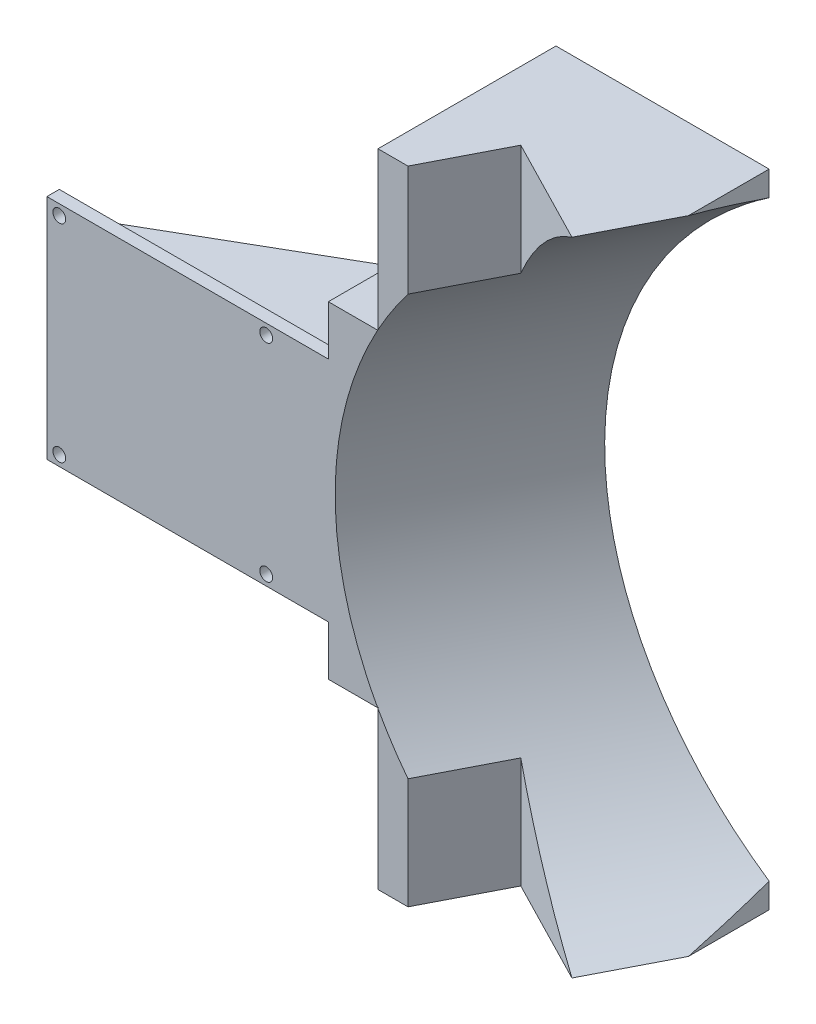
ISO-10303-21;
HEADER;
FILE_DESCRIPTION(('STEP AP214'),'2;1');
FILE_NAME('part.step','',(''),(''),'','','');
FILE_SCHEMA(('AUTOMOTIVE_DESIGN { 1 0 10303 214 1 1 1 1 }'));
ENDSEC;
DATA;
#1=APPLICATION_CONTEXT('core data for automotive mechanical design processes');
#2=APPLICATION_PROTOCOL_DEFINITION('international standard','automotive_design',2000,#1);
#3=PRODUCT_CONTEXT('',#1,'mechanical');
#4=PRODUCT('Part','Part','',(#3));
#5=PRODUCT_RELATED_PRODUCT_CATEGORY('part','',(#4));
#6=PRODUCT_DEFINITION_FORMATION('','',#4);
#7=PRODUCT_DEFINITION_CONTEXT('part definition',#1,'design');
#8=PRODUCT_DEFINITION('design','',#6,#7);
#9=PRODUCT_DEFINITION_SHAPE('','',#8);
#10=(LENGTH_UNIT() NAMED_UNIT(*) SI_UNIT(.MILLI.,.METRE.));
#11=(NAMED_UNIT(*) PLANE_ANGLE_UNIT() SI_UNIT($,.RADIAN.));
#12=(NAMED_UNIT(*) SI_UNIT($,.STERADIAN.) SOLID_ANGLE_UNIT());
#13=UNCERTAINTY_MEASURE_WITH_UNIT(LENGTH_MEASURE(1.E-05),#10,'distance_accuracy_value','');
#14=(GEOMETRIC_REPRESENTATION_CONTEXT(3) GLOBAL_UNCERTAINTY_ASSIGNED_CONTEXT((#13)) GLOBAL_UNIT_ASSIGNED_CONTEXT((#10,
#11,#12)) REPRESENTATION_CONTEXT('',''));
#15=CARTESIAN_POINT('',(0.,0.,0.));
#16=DIRECTION('',(0.,0.,1.));
#17=DIRECTION('',(1.,0.,0.));
#18=AXIS2_PLACEMENT_3D('',#15,#16,#17);
#19=CARTESIAN_POINT('',(0.,0.,0.));
#20=DIRECTION('',(0.,0.,1.));
#21=DIRECTION('',(1.,0.,0.));
#22=AXIS2_PLACEMENT_3D('',#19,#20,#21);
#23=PLANE('',#22);
#24=CARTESIAN_POINT('',(13.,25.,0.));
#25=DIRECTION('',(0.,0.,-1.));
#26=DIRECTION('',(-1.,0.,0.));
#27=AXIS2_PLACEMENT_3D('',#24,#25,#26);
#28=CIRCLE('',#27,1.55);
#29=CARTESIAN_POINT('',(11.45,25.,0.));
#30=VERTEX_POINT('',#29);
#31=EDGE_CURVE('E352',#30,#30,#28,.T.);
#32=ORIENTED_EDGE('',*,*,#31,.F.);
#33=EDGE_LOOP('',(#32));
#34=FACE_BOUND('',#33,.T.);
#35=CARTESIAN_POINT('',(-37.,25.,0.));
#36=DIRECTION('',(0.,0.,-1.));
#37=DIRECTION('',(-1.,0.,0.));
#38=AXIS2_PLACEMENT_3D('',#35,#36,#37);
#39=CIRCLE('',#38,1.55);
#40=CARTESIAN_POINT('',(-38.55,25.,0.));
#41=VERTEX_POINT('',#40);
#42=EDGE_CURVE('E357',#41,#41,#39,.T.);
#43=ORIENTED_EDGE('',*,*,#42,.F.);
#44=EDGE_LOOP('',(#43));
#45=FACE_BOUND('',#44,.T.);
#46=DIRECTION('',(1.,0.,0.));
#47=VECTOR('',#46,1.);
#48=CARTESIAN_POINT('',(-40.,18.5,0.));
#49=LINE('',#48,#47);
#50=CARTESIAN_POINT('',(-40.,18.5,0.));
#51=VERTEX_POINT('',#50);
#52=CARTESIAN_POINT('',(28.,18.5,0.));
#53=VERTEX_POINT('',#52);
#54=EDGE_CURVE('E226',#51,#53,#49,.T.);
#55=ORIENTED_EDGE('',*,*,#54,.F.);
#56=DIRECTION('',(0.,-1.,0.));
#57=VECTOR('',#56,1.);
#58=CARTESIAN_POINT('',(-40.,-27.5,0.));
#59=LINE('',#58,#57);
#60=CARTESIAN_POINT('',(-40.,27.5,0.));
#61=VERTEX_POINT('',#60);
#62=EDGE_CURVE('E387',#61,#51,#59,.T.);
#63=ORIENTED_EDGE('',*,*,#62,.F.);
#64=DIRECTION('',(-1.,0.,0.));
#65=VECTOR('',#64,1.);
#66=CARTESIAN_POINT('',(40.,27.5,0.));
#67=LINE('',#66,#65);
#68=CARTESIAN_POINT('',(28.,27.5,0.));
#69=VERTEX_POINT('',#68);
#70=EDGE_CURVE('E381',#69,#61,#67,.T.);
#71=ORIENTED_EDGE('',*,*,#70,.F.);
#72=DIRECTION('',(0.,1.,0.));
#73=VECTOR('',#72,1.);
#74=CARTESIAN_POINT('',(28.,27.5,0.));
#75=LINE('',#74,#73);
#76=EDGE_CURVE('E292',#53,#69,#75,.T.);
#77=ORIENTED_EDGE('',*,*,#76,.F.);
#78=EDGE_LOOP('',(#55,#63,#71,#77));
#79=FACE_BOUND('',#78,.T.);
#80=ADVANCED_FACE('F37',(#34,#45,#79),#23,.F.);
#81=CARTESIAN_POINT('',(-37.,-25.,0.));
#82=DIRECTION('',(0.,0.,-1.));
#83=DIRECTION('',(-1.,0.,0.));
#84=AXIS2_PLACEMENT_3D('',#81,#82,#83);
#85=CIRCLE('',#84,1.55);
#86=CARTESIAN_POINT('',(-38.55,-25.,0.));
#87=VERTEX_POINT('',#86);
#88=EDGE_CURVE('E353',#87,#87,#85,.T.);
#89=ORIENTED_EDGE('',*,*,#88,.F.);
#90=EDGE_LOOP('',(#89));
#91=FACE_BOUND('',#90,.T.);
#92=CARTESIAN_POINT('',(13.,-25.,0.));
#93=DIRECTION('',(0.,0.,-1.));
#94=DIRECTION('',(-1.,0.,0.));
#95=AXIS2_PLACEMENT_3D('',#92,#93,#94);
#96=CIRCLE('',#95,1.55);
#97=CARTESIAN_POINT('',(11.45,-25.,0.));
#98=VERTEX_POINT('',#97);
#99=EDGE_CURVE('E356',#98,#98,#96,.T.);
#100=ORIENTED_EDGE('',*,*,#99,.F.);
#101=EDGE_LOOP('',(#100));
#102=FACE_BOUND('',#101,.T.);
#103=DIRECTION('',(-1.,0.,0.));
#104=VECTOR('',#103,1.);
#105=CARTESIAN_POINT('',(-40.,-18.5,0.));
#106=LINE('',#105,#104);
#107=CARTESIAN_POINT('',(28.,-18.5,0.));
#108=VERTEX_POINT('',#107);
#109=CARTESIAN_POINT('',(-40.,-18.5,0.));
#110=VERTEX_POINT('',#109);
#111=EDGE_CURVE('E222',#108,#110,#106,.T.);
#112=ORIENTED_EDGE('',*,*,#111,.F.);
#113=CARTESIAN_POINT('',(28.,-27.5,0.));
#114=VERTEX_POINT('',#113);
#115=EDGE_CURVE('E293',#114,#108,#75,.T.);
#116=ORIENTED_EDGE('',*,*,#115,.F.);
#117=DIRECTION('',(1.,0.,0.));
#118=VECTOR('',#117,1.);
#119=CARTESIAN_POINT('',(40.,-27.5,0.));
#120=LINE('',#119,#118);
#121=CARTESIAN_POINT('',(-40.,-27.5,0.));
#122=VERTEX_POINT('',#121);
#123=EDGE_CURVE('E390',#122,#114,#120,.T.);
#124=ORIENTED_EDGE('',*,*,#123,.F.);
#125=EDGE_CURVE('E376',#110,#122,#59,.T.);
#126=ORIENTED_EDGE('',*,*,#125,.F.);
#127=EDGE_LOOP('',(#112,#116,#124,#126));
#128=FACE_BOUND('',#127,.T.);
#129=ADVANCED_FACE('F487',(#91,#102,#128),#23,.F.);
#130=CARTESIAN_POINT('',(28.,0.,0.));
#131=DIRECTION('',(-1.,0.,0.));
#132=DIRECTION('',(0.,0.,1.));
#133=AXIS2_PLACEMENT_3D('',#130,#131,#132);
#134=PLANE('',#133);
#135=DIRECTION('',(0.,-1.,0.));
#136=VECTOR('',#135,1.);
#137=CARTESIAN_POINT('',(28.,39.5,-40.));
#138=LINE('',#137,#136);
#139=CARTESIAN_POINT('',(28.,39.5,-40.));
#140=VERTEX_POINT('',#139);
#141=CARTESIAN_POINT('',(28.,18.5,-40.));
#142=VERTEX_POINT('',#141);
#143=EDGE_CURVE('E283',#140,#142,#138,.T.);
#144=ORIENTED_EDGE('',*,*,#143,.T.);
#145=DIRECTION('',(0.,0.,1.));
#146=VECTOR('',#145,1.);
#147=CARTESIAN_POINT('',(28.,18.5,-40.));
#148=LINE('',#147,#146);
#149=EDGE_CURVE('E221',#142,#53,#148,.T.);
#150=ORIENTED_EDGE('',*,*,#149,.T.);
#151=ORIENTED_EDGE('',*,*,#76,.T.);
#152=DIRECTION('',(0.,0.,1.));
#153=VECTOR('',#152,1.);
#154=CARTESIAN_POINT('',(28.,27.5,3.));
#155=LINE('',#154,#153);
#156=CARTESIAN_POINT('',(28.,27.5,3.));
#157=VERTEX_POINT('',#156);
#158=EDGE_CURVE('E296',#69,#157,#155,.T.);
#159=ORIENTED_EDGE('',*,*,#158,.T.);
#160=DIRECTION('',(0.,1.,0.));
#161=VECTOR('',#160,1.);
#162=CARTESIAN_POINT('',(28.,39.5,3.));
#163=LINE('',#162,#161);
#164=CARTESIAN_POINT('',(28.,39.5,3.));
#165=VERTEX_POINT('',#164);
#166=EDGE_CURVE('E298',#157,#165,#163,.T.);
#167=ORIENTED_EDGE('',*,*,#166,.T.);
#168=DIRECTION('',(0.,0.,-1.));
#169=VECTOR('',#168,1.);
#170=CARTESIAN_POINT('',(28.,39.5,-40.));
#171=LINE('',#170,#169);
#172=EDGE_CURVE('E300',#165,#140,#171,.T.);
#173=ORIENTED_EDGE('',*,*,#172,.T.);
#174=EDGE_LOOP('',(#144,#150,#151,#159,#167,#173));
#175=FACE_BOUND('',#174,.T.);
#176=ADVANCED_FACE('F493',(#175),#134,.T.);
#177=ORIENTED_EDGE('',*,*,#115,.T.);
#178=DIRECTION('',(0.,0.,1.));
#179=VECTOR('',#178,1.);
#180=CARTESIAN_POINT('',(28.,-18.5,-40.));
#181=LINE('',#180,#179);
#182=CARTESIAN_POINT('',(28.,-18.5,-40.));
#183=VERTEX_POINT('',#182);
#184=EDGE_CURVE('E232',#183,#108,#181,.T.);
#185=ORIENTED_EDGE('',*,*,#184,.F.);
#186=CARTESIAN_POINT('',(28.,-39.5,-40.));
#187=VERTEX_POINT('',#186);
#188=EDGE_CURVE('E286',#183,#187,#138,.T.);
#189=ORIENTED_EDGE('',*,*,#188,.T.);
#190=DIRECTION('',(0.,0.,1.));
#191=VECTOR('',#190,1.);
#192=CARTESIAN_POINT('',(28.,-39.5,-40.));
#193=LINE('',#192,#191);
#194=CARTESIAN_POINT('',(28.,-39.5,3.));
#195=VERTEX_POINT('',#194);
#196=EDGE_CURVE('E285',#187,#195,#193,.T.);
#197=ORIENTED_EDGE('',*,*,#196,.T.);
#198=DIRECTION('',(0.,1.,0.));
#199=VECTOR('',#198,1.);
#200=CARTESIAN_POINT('',(28.,-27.5,3.));
#201=LINE('',#200,#199);
#202=CARTESIAN_POINT('',(28.,-27.5,3.));
#203=VERTEX_POINT('',#202);
#204=EDGE_CURVE('E288',#195,#203,#201,.T.);
#205=ORIENTED_EDGE('',*,*,#204,.T.);
#206=DIRECTION('',(0.,0.,-1.));
#207=VECTOR('',#206,1.);
#208=CARTESIAN_POINT('',(28.,-27.5,0.));
#209=LINE('',#208,#207);
#210=EDGE_CURVE('E290',#203,#114,#209,.T.);
#211=ORIENTED_EDGE('',*,*,#210,.T.);
#212=EDGE_LOOP('',(#177,#185,#189,#197,#205,#211));
#213=FACE_BOUND('',#212,.T.);
#214=ADVANCED_FACE('F515',(#213),#134,.T.);
#215=CARTESIAN_POINT('',(0.,77.5,0.));
#216=DIRECTION('',(0.,1.,0.));
#217=DIRECTION('',(0.,0.,1.));
#218=AXIS2_PLACEMENT_3D('',#215,#216,#217);
#219=PLANE('',#218);
#220=DIRECTION('',(0.889287802318147,0.,0.457348012620761));
#221=VECTOR('',#220,1.);
#222=CARTESIAN_POINT('',(56.5,77.5,-15.));
#223=LINE('',#222,#221);
#224=CARTESIAN_POINT('',(56.5,77.5,-15.));
#225=VERTEX_POINT('',#224);
#226=CARTESIAN_POINT('',(81.9334748664187,77.5,-1.91992721155612));
#227=VERTEX_POINT('',#226);
#228=EDGE_CURVE('E268',#225,#227,#223,.T.);
#229=ORIENTED_EDGE('',*,*,#228,.T.);
#230=DIRECTION('',(0.457348012620761,0.,-0.889287802318147));
#231=VECTOR('',#230,1.);
#232=CARTESIAN_POINT('',(39.8574577053086,77.5,79.8945506017134));
#233=LINE('',#232,#231);
#234=CARTESIAN_POINT('',(91.5,77.5,-20.5215038601865));
#235=VERTEX_POINT('',#234);
#236=EDGE_CURVE('E265',#227,#235,#233,.T.);
#237=ORIENTED_EDGE('',*,*,#236,.T.);
#238=DIRECTION('',(0.,0.,-1.));
#239=VECTOR('',#238,1.);
#240=CARTESIAN_POINT('',(91.5,77.5,0.));
#241=LINE('',#240,#239);
#242=CARTESIAN_POINT('',(91.5,77.5,-40.));
#243=VERTEX_POINT('',#242);
#244=EDGE_CURVE('E347',#235,#243,#241,.T.);
#245=ORIENTED_EDGE('',*,*,#244,.T.);
#246=DIRECTION('',(1.,0.,0.));
#247=VECTOR('',#246,1.);
#248=CARTESIAN_POINT('',(91.5,77.5,-40.));
#249=LINE('',#248,#247);
#250=CARTESIAN_POINT('',(40.,77.5,-40.));
#251=VERTEX_POINT('',#250);
#252=EDGE_CURVE('E328',#251,#243,#249,.T.);
#253=ORIENTED_EDGE('',*,*,#252,.F.);
#254=DIRECTION('',(0.,0.,1.));
#255=VECTOR('',#254,1.);
#256=CARTESIAN_POINT('',(40.,77.5,0.));
#257=LINE('',#256,#255);
#258=CARTESIAN_POINT('',(40.,77.5,3.));
#259=VERTEX_POINT('',#258);
#260=EDGE_CURVE('E341',#251,#259,#257,.T.);
#261=ORIENTED_EDGE('',*,*,#260,.T.);
#262=DIRECTION('',(1.,0.,0.));
#263=VECTOR('',#262,1.);
#264=CARTESIAN_POINT('',(40.,77.5,3.));
#265=LINE('',#264,#263);
#266=CARTESIAN_POINT('',(47.2428571428572,77.5,3.));
#267=VERTEX_POINT('',#266);
#268=EDGE_CURVE('E344',#259,#267,#265,.T.);
#269=ORIENTED_EDGE('',*,*,#268,.T.);
#270=DIRECTION('',(-0.457348012620761,0.,0.889287802318147));
#271=VECTOR('',#270,1.);
#272=CARTESIAN_POINT('',(56.5,77.5,-15.));
#273=LINE('',#272,#271);
#274=EDGE_CURVE('E271',#225,#267,#273,.T.);
#275=ORIENTED_EDGE('',*,*,#274,.F.);
#276=EDGE_LOOP('',(#229,#237,#245,#253,#261,#269,#275));
#277=FACE_BOUND('',#276,.T.);
#278=ADVANCED_FACE('F421',(#277),#219,.T.);
#279=CARTESIAN_POINT('',(0.,-77.5,0.));
#280=DIRECTION('',(0.,-1.,0.));
#281=DIRECTION('',(1.,0.,0.));
#282=AXIS2_PLACEMENT_3D('',#279,#280,#281);
#283=PLANE('',#282);
#284=DIRECTION('',(0.,0.,1.));
#285=VECTOR('',#284,1.);
#286=CARTESIAN_POINT('',(91.5,-77.5,3.));
#287=LINE('',#286,#285);
#288=CARTESIAN_POINT('',(91.5,-77.5,-40.));
#289=VERTEX_POINT('',#288);
#290=CARTESIAN_POINT('',(91.5,-77.5,-20.5215038601866));
#291=VERTEX_POINT('',#290);
#292=EDGE_CURVE('E333',#289,#291,#287,.T.);
#293=ORIENTED_EDGE('',*,*,#292,.T.);
#294=DIRECTION('',(0.457348012620761,0.,-0.889287802318147));
#295=VECTOR('',#294,1.);
#296=CARTESIAN_POINT('',(39.8574577053086,-77.5,79.8945506017134));
#297=LINE('',#296,#295);
#298=CARTESIAN_POINT('',(81.9334748664186,-77.5,-1.91992721155614));
#299=VERTEX_POINT('',#298);
#300=EDGE_CURVE('E249',#291,#299,#297,.F.);
#301=ORIENTED_EDGE('',*,*,#300,.T.);
#302=DIRECTION('',(-0.889287802318147,0.,-0.457348012620761));
#303=VECTOR('',#302,1.);
#304=CARTESIAN_POINT('',(17.9186571981924,-77.5,-34.8418334409296));
#305=LINE('',#304,#303);
#306=CARTESIAN_POINT('',(56.5,-77.5,-15.));
#307=VERTEX_POINT('',#306);
#308=EDGE_CURVE('E402',#299,#307,#305,.T.);
#309=ORIENTED_EDGE('',*,*,#308,.T.);
#310=DIRECTION('',(0.457348012620761,0.,-0.889287802318147));
#311=VECTOR('',#310,1.);
#312=CARTESIAN_POINT('',(38.5813428018076,-77.5,19.8418334409296));
#313=LINE('',#312,#311);
#314=CARTESIAN_POINT('',(47.2428571428572,-77.5,3.));
#315=VERTEX_POINT('',#314);
#316=EDGE_CURVE('E399',#315,#307,#313,.T.);
#317=ORIENTED_EDGE('',*,*,#316,.F.);
#318=DIRECTION('',(-1.,0.,0.));
#319=VECTOR('',#318,1.);
#320=CARTESIAN_POINT('',(40.,-77.5,3.));
#321=LINE('',#320,#319);
#322=CARTESIAN_POINT('',(40.,-77.5,3.));
#323=VERTEX_POINT('',#322);
#324=EDGE_CURVE('E336',#315,#323,#321,.T.);
#325=ORIENTED_EDGE('',*,*,#324,.T.);
#326=DIRECTION('',(0.,0.,-1.));
#327=VECTOR('',#326,1.);
#328=CARTESIAN_POINT('',(40.,-77.5,3.));
#329=LINE('',#328,#327);
#330=CARTESIAN_POINT('',(40.,-77.5,-40.));
#331=VERTEX_POINT('',#330);
#332=EDGE_CURVE('E331',#323,#331,#329,.T.);
#333=ORIENTED_EDGE('',*,*,#332,.T.);
#334=DIRECTION('',(-1.,0.,0.));
#335=VECTOR('',#334,1.);
#336=CARTESIAN_POINT('',(91.5,-77.5,-40.));
#337=LINE('',#336,#335);
#338=EDGE_CURVE('E321',#289,#331,#337,.T.);
#339=ORIENTED_EDGE('',*,*,#338,.F.);
#340=EDGE_LOOP('',(#293,#301,#309,#317,#325,#333,#339));
#341=FACE_BOUND('',#340,.T.);
#342=ADVANCED_FACE('F456',(#341),#283,.T.);
#343=CARTESIAN_POINT('',(0.,0.,3.));
#344=DIRECTION('',(0.,0.,1.));
#345=DIRECTION('',(1.,0.,0.));
#346=AXIS2_PLACEMENT_3D('',#343,#344,#345);
#347=PLANE('',#346);
#348=DIRECTION('',(0.,1.,0.));
#349=VECTOR('',#348,1.);
#350=CARTESIAN_POINT('',(47.2428571428572,-106.5,3.));
#351=LINE('',#350,#349);
#352=CARTESIAN_POINT('',(47.2428571428572,-50.7048951129809,3.));
#353=VERTEX_POINT('',#352);
#354=EDGE_CURVE('E279',#315,#353,#351,.T.);
#355=ORIENTED_EDGE('',*,*,#354,.T.);
#356=CARTESIAN_POINT('',(130.857337308309,0.,3.));
#357=DIRECTION('',(0.,0.,1.));
#358=DIRECTION('',(1.,0.,0.));
#359=AXIS2_PLACEMENT_3D('',#356,#357,#358);
#360=ELLIPSE('',#359,101.204581649937,90.);
#361=CARTESIAN_POINT('',(40.,-39.643803944263,3.));
#362=VERTEX_POINT('',#361);
#363=EDGE_CURVE('E241',#353,#362,#360,.F.);
#364=ORIENTED_EDGE('',*,*,#363,.T.);
#365=DIRECTION('',(0.,1.,0.));
#366=VECTOR('',#365,1.);
#367=CARTESIAN_POINT('',(40.,-77.5,3.));
#368=LINE('',#367,#366);
#369=EDGE_CURVE('E338',#323,#362,#368,.T.);
#370=ORIENTED_EDGE('',*,*,#369,.F.);
#371=ORIENTED_EDGE('',*,*,#324,.F.);
#372=EDGE_LOOP('',(#355,#364,#370,#371));
#373=FACE_BOUND('',#372,.T.);
#374=ADVANCED_FACE('F461',(#373),#347,.T.);
#375=CARTESIAN_POINT('',(13.,-25.,3.));
#376=DIRECTION('',(0.,0.,1.));
#377=DIRECTION('',(1.,0.,0.));
#378=AXIS2_PLACEMENT_3D('',#375,#376,#377);
#379=CIRCLE('',#378,1.55);
#380=CARTESIAN_POINT('',(14.55,-25.,3.));
#381=VERTEX_POINT('',#380);
#382=EDGE_CURVE('E364',#381,#381,#379,.T.);
#383=ORIENTED_EDGE('',*,*,#382,.F.);
#384=EDGE_LOOP('',(#383));
#385=FACE_BOUND('',#384,.T.);
#386=CARTESIAN_POINT('',(-37.,-25.,3.));
#387=DIRECTION('',(0.,0.,1.));
#388=DIRECTION('',(1.,0.,0.));
#389=AXIS2_PLACEMENT_3D('',#386,#387,#388);
#390=CIRCLE('',#389,1.55);
#391=CARTESIAN_POINT('',(-35.45,-25.,3.));
#392=VERTEX_POINT('',#391);
#393=EDGE_CURVE('E367',#392,#392,#390,.T.);
#394=ORIENTED_EDGE('',*,*,#393,.F.);
#395=EDGE_LOOP('',(#394));
#396=FACE_BOUND('',#395,.T.);
#397=CARTESIAN_POINT('',(-37.,25.,3.));
#398=DIRECTION('',(0.,0.,1.));
#399=DIRECTION('',(1.,0.,0.));
#400=AXIS2_PLACEMENT_3D('',#397,#398,#399);
#401=CIRCLE('',#400,1.55);
#402=CARTESIAN_POINT('',(-35.45,25.,3.));
#403=VERTEX_POINT('',#402);
#404=EDGE_CURVE('E370',#403,#403,#401,.T.);
#405=ORIENTED_EDGE('',*,*,#404,.F.);
#406=EDGE_LOOP('',(#405));
#407=FACE_BOUND('',#406,.T.);
#408=CARTESIAN_POINT('',(13.,25.,3.));
#409=DIRECTION('',(0.,0.,1.));
#410=DIRECTION('',(1.,0.,0.));
#411=AXIS2_PLACEMENT_3D('',#408,#409,#410);
#412=CIRCLE('',#411,1.55);
#413=CARTESIAN_POINT('',(14.55,25.,3.));
#414=VERTEX_POINT('',#413);
#415=EDGE_CURVE('E373',#414,#414,#412,.T.);
#416=ORIENTED_EDGE('',*,*,#415,.F.);
#417=EDGE_LOOP('',(#416));
#418=FACE_BOUND('',#417,.T.);
#419=DIRECTION('',(1.,0.,0.));
#420=VECTOR('',#419,1.);
#421=CARTESIAN_POINT('',(28.,-39.5,3.));
#422=LINE('',#421,#420);
#423=CARTESIAN_POINT('',(39.9208367001529,-39.5,3.));
#424=VERTEX_POINT('',#423);
#425=EDGE_CURVE('E312',#195,#424,#422,.T.);
#426=ORIENTED_EDGE('',*,*,#425,.T.);
#427=CARTESIAN_POINT('',(39.9208367001529,39.5,3.));
#428=VERTEX_POINT('',#427);
#429=EDGE_CURVE('E247',#424,#428,#360,.F.);
#430=ORIENTED_EDGE('',*,*,#429,.T.);
#431=DIRECTION('',(1.,0.,0.));
#432=VECTOR('',#431,1.);
#433=CARTESIAN_POINT('',(28.,39.5,3.));
#434=LINE('',#433,#432);
#435=EDGE_CURVE('E309',#165,#428,#434,.T.);
#436=ORIENTED_EDGE('',*,*,#435,.F.);
#437=ORIENTED_EDGE('',*,*,#166,.F.);
#438=DIRECTION('',(-1.,0.,0.));
#439=VECTOR('',#438,1.);
#440=CARTESIAN_POINT('',(40.,27.5,3.));
#441=LINE('',#440,#439);
#442=CARTESIAN_POINT('',(-40.,27.5,3.));
#443=VERTEX_POINT('',#442);
#444=EDGE_CURVE('E384',#157,#443,#441,.T.);
#445=ORIENTED_EDGE('',*,*,#444,.T.);
#446=DIRECTION('',(0.,-1.,0.));
#447=VECTOR('',#446,1.);
#448=CARTESIAN_POINT('',(-40.,-27.5,3.));
#449=LINE('',#448,#447);
#450=CARTESIAN_POINT('',(-40.,-27.5,3.));
#451=VERTEX_POINT('',#450);
#452=EDGE_CURVE('E377',#443,#451,#449,.T.);
#453=ORIENTED_EDGE('',*,*,#452,.T.);
#454=DIRECTION('',(1.,0.,0.));
#455=VECTOR('',#454,1.);
#456=CARTESIAN_POINT('',(40.,-27.5,3.));
#457=LINE('',#456,#455);
#458=EDGE_CURVE('E380',#451,#203,#457,.T.);
#459=ORIENTED_EDGE('',*,*,#458,.T.);
#460=ORIENTED_EDGE('',*,*,#204,.F.);
#461=EDGE_LOOP('',(#426,#430,#436,#437,#445,#453,#459,#460));
#462=FACE_BOUND('',#461,.T.);
#463=ADVANCED_FACE('F437',(#385,#396,#407,#418,#462),#347,.T.);
#464=CARTESIAN_POINT('',(91.5,0.,0.));
#465=DIRECTION('',(1.,0.,0.));
#466=DIRECTION('',(0.,0.,-1.));
#467=AXIS2_PLACEMENT_3D('',#464,#465,#466);
#468=PLANE('',#467);
#469=DIRECTION('',(0.,-1.,0.));
#470=VECTOR('',#469,1.);
#471=CARTESIAN_POINT('',(91.5,77.5,-40.));
#472=LINE('',#471,#470);
#473=CARTESIAN_POINT('',(91.5,-71.4956804332756,-40.));
#474=VERTEX_POINT('',#473);
#475=EDGE_CURVE('E317',#474,#289,#472,.T.);
#476=ORIENTED_EDGE('',*,*,#475,.F.);
#477=CARTESIAN_POINT('',(91.5,0.,79.5281558772672));
#478=DIRECTION('',(1.,0.,0.));
#479=DIRECTION('',(0.,0.,-1.));
#480=AXIS2_PLACEMENT_3D('',#477,#478,#479);
#481=ELLIPSE('',#480,196.786686541544,90.);
#482=EDGE_CURVE('E254',#474,#291,#481,.F.);
#483=ORIENTED_EDGE('',*,*,#482,.T.);
#484=ORIENTED_EDGE('',*,*,#292,.F.);
#485=EDGE_LOOP('',(#476,#483,#484));
#486=FACE_BOUND('',#485,.T.);
#487=ADVANCED_FACE('F470',(#486),#468,.T.);
#488=CARTESIAN_POINT('',(28.,-39.5,-40.));
#489=DIRECTION('',(0.,1.,0.));
#490=DIRECTION('',(0.,0.,1.));
#491=AXIS2_PLACEMENT_3D('',#488,#489,#490);
#492=PLANE('',#491);
#493=DIRECTION('',(0.457348012620761,0.,-0.889287802318147));
#494=VECTOR('',#493,1.);
#495=CARTESIAN_POINT('',(8.63348894456285,-39.5,63.8365095247585));
#496=LINE('',#495,#494);
#497=CARTESIAN_POINT('',(40.,-39.5,2.84607136140836));
#498=VERTEX_POINT('',#497);
#499=EDGE_CURVE('E252',#424,#498,#496,.T.);
#500=ORIENTED_EDGE('',*,*,#499,.F.);
#501=ORIENTED_EDGE('',*,*,#425,.F.);
#502=ORIENTED_EDGE('',*,*,#196,.F.);
#503=DIRECTION('',(1.,0.,0.));
#504=VECTOR('',#503,1.);
#505=CARTESIAN_POINT('',(28.,-39.5,-40.));
#506=LINE('',#505,#504);
#507=CARTESIAN_POINT('',(40.,-39.5,-40.));
#508=VERTEX_POINT('',#507);
#509=EDGE_CURVE('E315',#187,#508,#506,.T.);
#510=ORIENTED_EDGE('',*,*,#509,.T.);
#511=DIRECTION('',(0.,0.,1.));
#512=VECTOR('',#511,1.);
#513=CARTESIAN_POINT('',(40.,-39.5,-40.));
#514=LINE('',#513,#512);
#515=EDGE_CURVE('E282',#508,#498,#514,.T.);
#516=ORIENTED_EDGE('',*,*,#515,.T.);
#517=EDGE_LOOP('',(#500,#501,#502,#510,#516));
#518=FACE_BOUND('',#517,.T.);
#519=ADVANCED_FACE('F444',(#518),#492,.F.);
#520=CARTESIAN_POINT('',(28.,39.5,-40.));
#521=DIRECTION('',(0.,-1.,0.));
#522=DIRECTION('',(0.,0.,-1.));
#523=AXIS2_PLACEMENT_3D('',#520,#521,#522);
#524=PLANE('',#523);
#525=DIRECTION('',(0.457348012620761,0.,-0.889287802318147));
#526=VECTOR('',#525,1.);
#527=CARTESIAN_POINT('',(8.63348894456285,39.5,63.8365095247585));
#528=LINE('',#527,#526);
#529=CARTESIAN_POINT('',(40.,39.5,2.84607136140843));
#530=VERTEX_POINT('',#529);
#531=EDGE_CURVE('E258',#530,#428,#528,.F.);
#532=ORIENTED_EDGE('',*,*,#531,.F.);
#533=DIRECTION('',(0.,0.,-1.));
#534=VECTOR('',#533,1.);
#535=CARTESIAN_POINT('',(40.,39.5,-40.));
#536=LINE('',#535,#534);
#537=CARTESIAN_POINT('',(40.,39.5,-40.));
#538=VERTEX_POINT('',#537);
#539=EDGE_CURVE('E305',#530,#538,#536,.T.);
#540=ORIENTED_EDGE('',*,*,#539,.T.);
#541=DIRECTION('',(1.,0.,0.));
#542=VECTOR('',#541,1.);
#543=CARTESIAN_POINT('',(28.,39.5,-40.));
#544=LINE('',#543,#542);
#545=EDGE_CURVE('E302',#140,#538,#544,.T.);
#546=ORIENTED_EDGE('',*,*,#545,.F.);
#547=ORIENTED_EDGE('',*,*,#172,.F.);
#548=ORIENTED_EDGE('',*,*,#435,.T.);
#549=EDGE_LOOP('',(#532,#540,#546,#547,#548));
#550=FACE_BOUND('',#549,.T.);
#551=ADVANCED_FACE('F431',(#550),#524,.F.);
#552=CARTESIAN_POINT('',(56.5,-106.5,-15.));
#553=DIRECTION('',(-0.457348012620761,0.,0.889287802318147));
#554=DIRECTION('',(0.889287802318147,0.,0.457348012620761));
#555=AXIS2_PLACEMENT_3D('',#552,#553,#554);
#556=PLANE('',#555);
#557=ORIENTED_EDGE('',*,*,#308,.F.);
#558=CARTESIAN_POINT('',(122.625073081135,0.,19.0071804417266));
#559=DIRECTION('',(-0.457348012620761,0.,0.889287802318147));
#560=DIRECTION('',(0.889287802318147,0.,0.457348012620761));
#561=AXIS2_PLACEMENT_3D('',#558,#559,#560);
#562=CIRCLE('',#561,90.);
#563=CARTESIAN_POINT('',(56.5,-50.7048951129809,-15.));
#564=VERTEX_POINT('',#563);
#565=EDGE_CURVE('E238',#299,#564,#562,.F.);
#566=ORIENTED_EDGE('',*,*,#565,.T.);
#567=DIRECTION('',(0.,1.,0.));
#568=VECTOR('',#567,1.);
#569=CARTESIAN_POINT('',(56.5,-106.5,-15.));
#570=LINE('',#569,#568);
#571=EDGE_CURVE('E275',#307,#564,#570,.T.);
#572=ORIENTED_EDGE('',*,*,#571,.F.);
#573=EDGE_LOOP('',(#557,#566,#572));
#574=FACE_BOUND('',#573,.T.);
#575=ADVANCED_FACE('F468',(#574),#556,.T.);
#576=CARTESIAN_POINT('',(56.5,-106.5,-15.));
#577=DIRECTION('',(-0.889287802318147,0.,-0.457348012620761));
#578=DIRECTION('',(-0.457348012620761,0.,0.889287802318147));
#579=AXIS2_PLACEMENT_3D('',#576,#577,#578);
#580=PLANE('',#579);
#581=DIRECTION('',(0.457348012620761,0.,-0.889287802318147));
#582=VECTOR('',#581,1.);
#583=CARTESIAN_POINT('',(14.42398283889,50.7048951129809,66.8144778132696));
#584=LINE('',#583,#582);
#585=CARTESIAN_POINT('',(56.5,50.7048951129808,-15.));
#586=VERTEX_POINT('',#585);
#587=CARTESIAN_POINT('',(47.2428571428572,50.7048951129809,3.));
#588=VERTEX_POINT('',#587);
#589=EDGE_CURVE('E45',#586,#588,#584,.F.);
#590=ORIENTED_EDGE('',*,*,#589,.F.);
#591=EDGE_CURVE('E274',#586,#225,#570,.T.);
#592=ORIENTED_EDGE('',*,*,#591,.T.);
#593=ORIENTED_EDGE('',*,*,#274,.T.);
#594=EDGE_CURVE('E278',#588,#267,#351,.T.);
#595=ORIENTED_EDGE('',*,*,#594,.F.);
#596=EDGE_LOOP('',(#590,#592,#593,#595));
#597=FACE_BOUND('',#596,.T.);
#598=ADVANCED_FACE('F417',(#597),#580,.F.);
#599=DIRECTION('',(0.457348012620761,0.,-0.889287802318147));
#600=VECTOR('',#599,1.);
#601=CARTESIAN_POINT('',(14.42398283889,-50.7048951129809,66.8144778132696));
#602=LINE('',#601,#600);
#603=EDGE_CURVE('E404',#353,#564,#602,.T.);
#604=ORIENTED_EDGE('',*,*,#603,.F.);
#605=ORIENTED_EDGE('',*,*,#354,.F.);
#606=ORIENTED_EDGE('',*,*,#316,.T.);
#607=ORIENTED_EDGE('',*,*,#571,.T.);
#608=EDGE_LOOP('',(#604,#605,#606,#607));
#609=FACE_BOUND('',#608,.T.);
#610=ADVANCED_FACE('F464',(#609),#580,.F.);
#611=CARTESIAN_POINT('',(40.,77.5,0.));
#612=DIRECTION('',(1.,0.,0.));
#613=DIRECTION('',(0.,0.,-1.));
#614=AXIS2_PLACEMENT_3D('',#611,#612,#613);
#615=PLANE('',#614);
#616=CARTESIAN_POINT('',(40.,0.,179.667044766156));
#617=DIRECTION('',(1.,0.,0.));
#618=DIRECTION('',(0.,0.,-1.));
#619=AXIS2_PLACEMENT_3D('',#616,#617,#618);
#620=ELLIPSE('',#619,196.786686541544,90.);
#621=EDGE_CURVE('E245',#498,#362,#620,.F.);
#622=ORIENTED_EDGE('',*,*,#621,.F.);
#623=ORIENTED_EDGE('',*,*,#515,.F.);
#624=DIRECTION('',(0.,1.,0.));
#625=VECTOR('',#624,1.);
#626=CARTESIAN_POINT('',(40.,77.5,-40.));
#627=LINE('',#626,#625);
#628=EDGE_CURVE('E325',#331,#508,#627,.T.);
#629=ORIENTED_EDGE('',*,*,#628,.F.);
#630=ORIENTED_EDGE('',*,*,#332,.F.);
#631=ORIENTED_EDGE('',*,*,#369,.T.);
#632=EDGE_LOOP('',(#622,#623,#629,#630,#631));
#633=FACE_BOUND('',#632,.T.);
#634=ADVANCED_FACE('F450',(#633),#615,.F.);
#635=CARTESIAN_POINT('',(40.,0.,179.667044766156));
#636=DIRECTION('',(1.,0.,0.));
#637=DIRECTION('',(0.,0.,-1.));
#638=AXIS2_PLACEMENT_3D('',#635,#636,#637);
#639=ELLIPSE('',#638,196.786686541544,90.);
#640=CARTESIAN_POINT('',(40.,39.6438039442631,3.));
#641=VERTEX_POINT('',#640);
#642=EDGE_CURVE('E263',#641,#530,#639,.F.);
#643=ORIENTED_EDGE('',*,*,#642,.F.);
#644=DIRECTION('',(0.,-1.,0.));
#645=VECTOR('',#644,1.);
#646=CARTESIAN_POINT('',(40.,77.5,3.));
#647=LINE('',#646,#645);
#648=EDGE_CURVE('E349',#259,#641,#647,.T.);
#649=ORIENTED_EDGE('',*,*,#648,.F.);
#650=ORIENTED_EDGE('',*,*,#260,.F.);
#651=EDGE_CURVE('E324',#538,#251,#627,.T.);
#652=ORIENTED_EDGE('',*,*,#651,.F.);
#653=ORIENTED_EDGE('',*,*,#539,.F.);
#654=EDGE_LOOP('',(#643,#649,#650,#652,#653));
#655=FACE_BOUND('',#654,.T.);
#656=ADVANCED_FACE('F426',(#655),#615,.F.);
#657=CARTESIAN_POINT('',(40.,-27.5,3.));
#658=DIRECTION('',(0.,1.,0.));
#659=DIRECTION('',(-1.,0.,0.));
#660=AXIS2_PLACEMENT_3D('',#657,#658,#659);
#661=PLANE('',#660);
#662=ORIENTED_EDGE('',*,*,#123,.T.);
#663=ORIENTED_EDGE('',*,*,#210,.F.);
#664=ORIENTED_EDGE('',*,*,#458,.F.);
#665=DIRECTION('',(0.,0.,-1.));
#666=VECTOR('',#665,1.);
#667=CARTESIAN_POINT('',(-40.,-27.5,3.));
#668=LINE('',#667,#666);
#669=EDGE_CURVE('E396',#451,#122,#668,.T.);
#670=ORIENTED_EDGE('',*,*,#669,.T.);
#671=EDGE_LOOP('',(#662,#663,#664,#670));
#672=FACE_BOUND('',#671,.T.);
#673=ADVANCED_FACE('F501',(#672),#661,.F.);
#674=CARTESIAN_POINT('',(40.,27.5,3.));
#675=DIRECTION('',(0.,-1.,0.));
#676=DIRECTION('',(1.,0.,0.));
#677=AXIS2_PLACEMENT_3D('',#674,#675,#676);
#678=PLANE('',#677);
#679=ORIENTED_EDGE('',*,*,#444,.F.);
#680=ORIENTED_EDGE('',*,*,#158,.F.);
#681=ORIENTED_EDGE('',*,*,#70,.T.);
#682=DIRECTION('',(0.,0.,-1.));
#683=VECTOR('',#682,1.);
#684=CARTESIAN_POINT('',(-40.,27.5,3.));
#685=LINE('',#684,#683);
#686=EDGE_CURVE('E386',#443,#61,#685,.T.);
#687=ORIENTED_EDGE('',*,*,#686,.F.);
#688=EDGE_LOOP('',(#679,#680,#681,#687));
#689=FACE_BOUND('',#688,.T.);
#690=ADVANCED_FACE('F499',(#689),#678,.F.);
#691=CARTESIAN_POINT('',(-40.,-27.5,3.));
#692=DIRECTION('',(1.,0.,0.));
#693=DIRECTION('',(0.,0.,-1.));
#694=AXIS2_PLACEMENT_3D('',#691,#692,#693);
#695=PLANE('',#694);
#696=DIRECTION('',(0.,0.,1.));
#697=VECTOR('',#696,1.);
#698=CARTESIAN_POINT('',(-40.,18.5,-40.));
#699=LINE('',#698,#697);
#700=CARTESIAN_POINT('',(-40.,18.5,-5.84857022564558));
#701=VERTEX_POINT('',#700);
#702=EDGE_CURVE('E236',#701,#51,#699,.T.);
#703=ORIENTED_EDGE('',*,*,#702,.F.);
#704=DIRECTION('',(0.,1.,0.));
#705=VECTOR('',#704,1.);
#706=CARTESIAN_POINT('',(-40.,-37.5,-5.84857022564558));
#707=LINE('',#706,#705);
#708=CARTESIAN_POINT('',(-40.,-18.5,-5.84857022564558));
#709=VERTEX_POINT('',#708);
#710=EDGE_CURVE('E204',#709,#701,#707,.T.);
#711=ORIENTED_EDGE('',*,*,#710,.F.);
#712=DIRECTION('',(0.,0.,1.));
#713=VECTOR('',#712,1.);
#714=CARTESIAN_POINT('',(-40.,-18.5,-40.));
#715=LINE('',#714,#713);
#716=EDGE_CURVE('E59',#709,#110,#715,.T.);
#717=ORIENTED_EDGE('',*,*,#716,.T.);
#718=ORIENTED_EDGE('',*,*,#125,.T.);
#719=ORIENTED_EDGE('',*,*,#669,.F.);
#720=ORIENTED_EDGE('',*,*,#452,.F.);
#721=ORIENTED_EDGE('',*,*,#686,.T.);
#722=ORIENTED_EDGE('',*,*,#62,.T.);
#723=EDGE_LOOP('',(#703,#711,#717,#718,#719,#720,#721,#722));
#724=FACE_BOUND('',#723,.T.);
#725=ADVANCED_FACE('F39',(#724),#695,.F.);
#726=ORIENTED_EDGE('',*,*,#648,.T.);
#727=EDGE_CURVE('E246',#641,#588,#360,.F.);
#728=ORIENTED_EDGE('',*,*,#727,.T.);
#729=ORIENTED_EDGE('',*,*,#594,.T.);
#730=ORIENTED_EDGE('',*,*,#268,.F.);
#731=EDGE_LOOP('',(#726,#728,#729,#730));
#732=FACE_BOUND('',#731,.T.);
#733=ADVANCED_FACE('F415',(#732),#347,.T.);
#734=CARTESIAN_POINT('',(13.,-25.,24.5));
#735=DIRECTION('',(0.,0.,-1.));
#736=DIRECTION('',(-1.,0.,0.));
#737=AXIS2_PLACEMENT_3D('',#734,#735,#736);
#738=CYLINDRICAL_SURFACE('',#737,1.55);
#739=ORIENTED_EDGE('',*,*,#382,.T.);
#740=EDGE_LOOP('',(#739));
#741=FACE_BOUND('',#740,.T.);
#742=ORIENTED_EDGE('',*,*,#99,.T.);
#743=EDGE_LOOP('',(#742));
#744=FACE_BOUND('',#743,.T.);
#745=ADVANCED_FACE('F657',(#741,#744),#738,.F.);
#746=CARTESIAN_POINT('',(-37.,-25.,24.5));
#747=DIRECTION('',(0.,0.,-1.));
#748=DIRECTION('',(-1.,0.,0.));
#749=AXIS2_PLACEMENT_3D('',#746,#747,#748);
#750=CYLINDRICAL_SURFACE('',#749,1.55);
#751=ORIENTED_EDGE('',*,*,#393,.T.);
#752=EDGE_LOOP('',(#751));
#753=FACE_BOUND('',#752,.T.);
#754=ORIENTED_EDGE('',*,*,#88,.T.);
#755=EDGE_LOOP('',(#754));
#756=FACE_BOUND('',#755,.T.);
#757=ADVANCED_FACE('F649',(#753,#756),#750,.F.);
#758=CARTESIAN_POINT('',(-37.,25.,24.5));
#759=DIRECTION('',(0.,0.,-1.));
#760=DIRECTION('',(-1.,0.,0.));
#761=AXIS2_PLACEMENT_3D('',#758,#759,#760);
#762=CYLINDRICAL_SURFACE('',#761,1.55);
#763=ORIENTED_EDGE('',*,*,#404,.T.);
#764=EDGE_LOOP('',(#763));
#765=FACE_BOUND('',#764,.T.);
#766=ORIENTED_EDGE('',*,*,#42,.T.);
#767=EDGE_LOOP('',(#766));
#768=FACE_BOUND('',#767,.T.);
#769=ADVANCED_FACE('F641',(#765,#768),#762,.F.);
#770=CARTESIAN_POINT('',(13.,25.,24.5));
#771=DIRECTION('',(0.,0.,-1.));
#772=DIRECTION('',(-1.,0.,0.));
#773=AXIS2_PLACEMENT_3D('',#770,#771,#772);
#774=CYLINDRICAL_SURFACE('',#773,1.55);
#775=ORIENTED_EDGE('',*,*,#415,.T.);
#776=EDGE_LOOP('',(#775));
#777=FACE_BOUND('',#776,.T.);
#778=ORIENTED_EDGE('',*,*,#31,.T.);
#779=EDGE_LOOP('',(#778));
#780=FACE_BOUND('',#779,.T.);
#781=ADVANCED_FACE('F484',(#777,#780),#774,.F.);
#782=ORIENTED_EDGE('',*,*,#244,.F.);
#783=CARTESIAN_POINT('',(91.5,71.4956804332756,-40.));
#784=VERTEX_POINT('',#783);
#785=EDGE_CURVE('E257',#235,#784,#481,.F.);
#786=ORIENTED_EDGE('',*,*,#785,.T.);
#787=EDGE_CURVE('E318',#243,#784,#472,.T.);
#788=ORIENTED_EDGE('',*,*,#787,.F.);
#789=EDGE_LOOP('',(#782,#786,#788));
#790=FACE_BOUND('',#789,.T.);
#791=ADVANCED_FACE('F473',(#790),#468,.T.);
#792=CARTESIAN_POINT('',(0.,0.,-40.));
#793=DIRECTION('',(0.,0.,-1.));
#794=DIRECTION('',(-1.,0.,0.));
#795=AXIS2_PLACEMENT_3D('',#792,#793,#794);
#796=PLANE('',#795);
#797=DIRECTION('',(0.,1.,0.));
#798=VECTOR('',#797,1.);
#799=CARTESIAN_POINT('',(19.2101839935644,-37.5,-40.));
#800=LINE('',#799,#798);
#801=CARTESIAN_POINT('',(19.2101839935644,-18.5,-40.));
#802=VERTEX_POINT('',#801);
#803=CARTESIAN_POINT('',(19.2101839935644,18.5,-40.));
#804=VERTEX_POINT('',#803);
#805=EDGE_CURVE('E52',#802,#804,#800,.T.);
#806=ORIENTED_EDGE('',*,*,#805,.T.);
#807=DIRECTION('',(1.,0.,0.));
#808=VECTOR('',#807,1.);
#809=CARTESIAN_POINT('',(-40.,18.5,-40.));
#810=LINE('',#809,#808);
#811=EDGE_CURVE('E213',#804,#142,#810,.T.);
#812=ORIENTED_EDGE('',*,*,#811,.T.);
#813=ORIENTED_EDGE('',*,*,#143,.F.);
#814=ORIENTED_EDGE('',*,*,#545,.T.);
#815=ORIENTED_EDGE('',*,*,#651,.T.);
#816=ORIENTED_EDGE('',*,*,#252,.T.);
#817=ORIENTED_EDGE('',*,*,#787,.T.);
#818=CARTESIAN_POINT('',(152.971623022595,0.,-40.));
#819=DIRECTION('',(0.,0.,-1.));
#820=DIRECTION('',(1.,0.,0.));
#821=AXIS2_PLACEMENT_3D('',#818,#819,#820);
#822=ELLIPSE('',#821,101.204581649937,90.);
#823=EDGE_CURVE('E260',#784,#474,#822,.F.);
#824=ORIENTED_EDGE('',*,*,#823,.T.);
#825=ORIENTED_EDGE('',*,*,#475,.T.);
#826=ORIENTED_EDGE('',*,*,#338,.T.);
#827=ORIENTED_EDGE('',*,*,#628,.T.);
#828=ORIENTED_EDGE('',*,*,#509,.F.);
#829=ORIENTED_EDGE('',*,*,#188,.F.);
#830=DIRECTION('',(-1.,0.,0.));
#831=VECTOR('',#830,1.);
#832=CARTESIAN_POINT('',(-40.,-18.5,-40.));
#833=LINE('',#832,#831);
#834=EDGE_CURVE('E216',#183,#802,#833,.T.);
#835=ORIENTED_EDGE('',*,*,#834,.T.);
#836=EDGE_LOOP('',(#806,#812,#813,#814,#815,#816,#817,#824,#825,#826,#827,#828,#829,#835));
#837=FACE_BOUND('',#836,.T.);
#838=ADVANCED_FACE('F211',(#837),#796,.T.);
#839=ORIENTED_EDGE('',*,*,#591,.F.);
#840=EDGE_CURVE('E242',#586,#227,#562,.F.);
#841=ORIENTED_EDGE('',*,*,#840,.T.);
#842=ORIENTED_EDGE('',*,*,#228,.F.);
#843=EDGE_LOOP('',(#839,#841,#842));
#844=FACE_BOUND('',#843,.T.);
#845=ADVANCED_FACE('F531',(#844),#556,.T.);
#846=CARTESIAN_POINT('',(80.5490559200251,0.,100.821658254996));
#847=DIRECTION('',(0.457348012620761,0.,-0.889287802318147));
#848=DIRECTION('',(-0.889287802318147,0.,-0.457348012620761));
#849=AXIS2_PLACEMENT_3D('',#846,#847,#848);
#850=CYLINDRICAL_SURFACE('',#849,90.);
#851=ORIENTED_EDGE('',*,*,#589,.T.);
#852=ORIENTED_EDGE('',*,*,#727,.F.);
#853=ORIENTED_EDGE('',*,*,#642,.T.);
#854=ORIENTED_EDGE('',*,*,#531,.T.);
#855=ORIENTED_EDGE('',*,*,#429,.F.);
#856=ORIENTED_EDGE('',*,*,#499,.T.);
#857=ORIENTED_EDGE('',*,*,#621,.T.);
#858=ORIENTED_EDGE('',*,*,#363,.F.);
#859=ORIENTED_EDGE('',*,*,#603,.T.);
#860=ORIENTED_EDGE('',*,*,#565,.F.);
#861=ORIENTED_EDGE('',*,*,#300,.F.);
#862=ORIENTED_EDGE('',*,*,#482,.F.);
#863=ORIENTED_EDGE('',*,*,#823,.F.);
#864=ORIENTED_EDGE('',*,*,#785,.F.);
#865=ORIENTED_EDGE('',*,*,#236,.F.);
#866=ORIENTED_EDGE('',*,*,#840,.F.);
#867=EDGE_LOOP('',(#851,#852,#853,#854,#855,#856,#857,#858,#859,#860,#861,#862,#863,#864,#865,#866));
#868=FACE_BOUND('',#867,.T.);
#869=ADVANCED_FACE('F408',(#868),#850,.F.);
#870=CARTESIAN_POINT('',(-40.,18.5,-40.));
#871=DIRECTION('',(0.,-1.,0.));
#872=DIRECTION('',(1.,0.,0.));
#873=AXIS2_PLACEMENT_3D('',#870,#871,#872);
#874=PLANE('',#873);
#875=ORIENTED_EDGE('',*,*,#811,.F.);
#876=DIRECTION('',(0.866238089502584,0.,-0.499631436455827));
#877=VECTOR('',#876,1.);
#878=CARTESIAN_POINT('',(-40.,18.5,-5.84857022564558));
#879=LINE('',#878,#877);
#880=EDGE_CURVE('E202',#701,#804,#879,.T.);
#881=ORIENTED_EDGE('',*,*,#880,.F.);
#882=ORIENTED_EDGE('',*,*,#702,.T.);
#883=ORIENTED_EDGE('',*,*,#54,.T.);
#884=ORIENTED_EDGE('',*,*,#149,.F.);
#885=EDGE_LOOP('',(#875,#881,#882,#883,#884));
#886=FACE_BOUND('',#885,.T.);
#887=ADVANCED_FACE('F219',(#886),#874,.F.);
#888=CARTESIAN_POINT('',(-40.,-18.5,-40.));
#889=DIRECTION('',(0.,1.,0.));
#890=DIRECTION('',(-1.,0.,0.));
#891=AXIS2_PLACEMENT_3D('',#888,#889,#890);
#892=PLANE('',#891);
#893=ORIENTED_EDGE('',*,*,#716,.F.);
#894=DIRECTION('',(0.866238089502584,0.,-0.499631436455827));
#895=VECTOR('',#894,1.);
#896=CARTESIAN_POINT('',(-25.2192686738154,-18.5,-14.373845336337));
#897=LINE('',#896,#895);
#898=EDGE_CURVE('E11',#709,#802,#897,.T.);
#899=ORIENTED_EDGE('',*,*,#898,.T.);
#900=ORIENTED_EDGE('',*,*,#834,.F.);
#901=ORIENTED_EDGE('',*,*,#184,.T.);
#902=ORIENTED_EDGE('',*,*,#111,.T.);
#903=EDGE_LOOP('',(#893,#899,#900,#901,#902));
#904=FACE_BOUND('',#903,.T.);
#905=ADVANCED_FACE('F517',(#904),#892,.F.);
#906=CARTESIAN_POINT('',(-40.,-37.5,-5.84857022564558));
#907=DIRECTION('',(0.499631436455827,0.,0.866238089502584));
#908=DIRECTION('',(0.866238089502584,0.,-0.499631436455827));
#909=AXIS2_PLACEMENT_3D('',#906,#907,#908);
#910=PLANE('',#909);
#911=ORIENTED_EDGE('',*,*,#710,.T.);
#912=ORIENTED_EDGE('',*,*,#880,.T.);
#913=ORIENTED_EDGE('',*,*,#805,.F.);
#914=ORIENTED_EDGE('',*,*,#898,.F.);
#915=EDGE_LOOP('',(#911,#912,#913,#914));
#916=FACE_BOUND('',#915,.T.);
#917=ADVANCED_FACE('F203',(#916),#910,.F.);
#918=CLOSED_SHELL('',(#80,#129,#176,#214,#278,#342,#374,#463,#487,#519,#551,#575,#598,#610,#634,
#656,#673,#690,#725,#733,#745,#757,#769,#781,#791,#838,#845,#869,#887,#905,#917));
#919=MANIFOLD_SOLID_BREP('B2',#918);
#920=ADVANCED_BREP_SHAPE_REPRESENTATION('',(#18,#919),#14);
#921=SHAPE_DEFINITION_REPRESENTATION(#9,#920);
ENDSEC;
END-ISO-10303-21;
